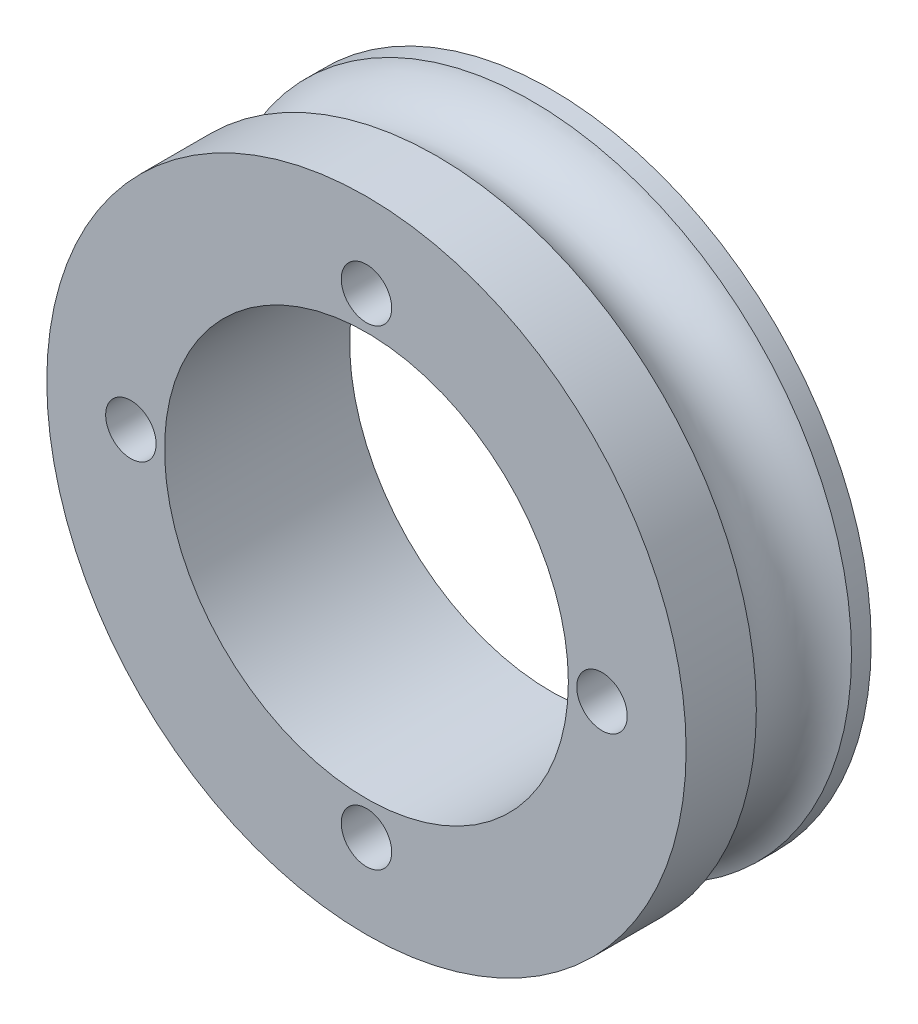
ISO-10303-21;
HEADER;
FILE_DESCRIPTION(('STEP AP214'),'2;1');
FILE_NAME('part.step','',(''),(''),'','','');
FILE_SCHEMA(('AUTOMOTIVE_DESIGN { 1 0 10303 214 1 1 1 1 }'));
ENDSEC;
DATA;
#1=APPLICATION_CONTEXT('core data for automotive mechanical design processes');
#2=APPLICATION_PROTOCOL_DEFINITION('international standard','automotive_design',2000,#1);
#3=PRODUCT_CONTEXT('',#1,'mechanical');
#4=PRODUCT('Part','Part','',(#3));
#5=PRODUCT_RELATED_PRODUCT_CATEGORY('part','',(#4));
#6=PRODUCT_DEFINITION_FORMATION('','',#4);
#7=PRODUCT_DEFINITION_CONTEXT('part definition',#1,'design');
#8=PRODUCT_DEFINITION('design','',#6,#7);
#9=PRODUCT_DEFINITION_SHAPE('','',#8);
#10=(LENGTH_UNIT() NAMED_UNIT(*) SI_UNIT(.MILLI.,.METRE.));
#11=(NAMED_UNIT(*) PLANE_ANGLE_UNIT() SI_UNIT($,.RADIAN.));
#12=(NAMED_UNIT(*) SI_UNIT($,.STERADIAN.) SOLID_ANGLE_UNIT());
#13=UNCERTAINTY_MEASURE_WITH_UNIT(LENGTH_MEASURE(1.E-05),#10,'distance_accuracy_value','');
#14=(GEOMETRIC_REPRESENTATION_CONTEXT(3) GLOBAL_UNCERTAINTY_ASSIGNED_CONTEXT((#13)) GLOBAL_UNIT_ASSIGNED_CONTEXT((#10,
#11,#12)) REPRESENTATION_CONTEXT('',''));
#15=CARTESIAN_POINT('',(0.,0.,0.));
#16=DIRECTION('',(0.,0.,1.));
#17=DIRECTION('',(1.,0.,0.));
#18=AXIS2_PLACEMENT_3D('',#15,#16,#17);
#19=CARTESIAN_POINT('',(0.,0.,11.));
#20=DIRECTION('',(0.,0.,-1.));
#21=DIRECTION('',(-1.,0.,0.));
#22=AXIS2_PLACEMENT_3D('',#19,#20,#21);
#23=CYLINDRICAL_SURFACE('',#22,19.);
#24=CARTESIAN_POINT('',(0.,0.,11.));
#25=DIRECTION('',(0.,0.,1.));
#26=DIRECTION('',(1.,0.,0.));
#27=AXIS2_PLACEMENT_3D('',#24,#25,#26);
#28=CIRCLE('',#27,19.);
#29=CARTESIAN_POINT('',(19.,0.,11.));
#30=VERTEX_POINT('',#29);
#31=EDGE_CURVE('E10',#30,#30,#28,.T.);
#32=ORIENTED_EDGE('',*,*,#31,.F.);
#33=EDGE_LOOP('',(#32));
#34=FACE_BOUND('',#33,.T.);
#35=CARTESIAN_POINT('',(0.,0.,6.82842712474619));
#36=DIRECTION('',(0.,0.,-1.));
#37=DIRECTION('',(-1.,0.,0.));
#38=AXIS2_PLACEMENT_3D('',#35,#36,#37);
#39=CIRCLE('',#38,19.);
#40=CARTESIAN_POINT('',(-19.,0.,6.82842712474619));
#41=VERTEX_POINT('',#40);
#42=EDGE_CURVE('E34',#41,#41,#39,.T.);
#43=ORIENTED_EDGE('',*,*,#42,.F.);
#44=EDGE_LOOP('',(#43));
#45=FACE_BOUND('',#44,.T.);
#46=ADVANCED_FACE('F31',(#34,#45),#23,.T.);
#47=CARTESIAN_POINT('',(0.,0.,0.));
#48=DIRECTION('',(0.,0.,1.));
#49=DIRECTION('',(1.,0.,0.));
#50=AXIS2_PLACEMENT_3D('',#47,#48,#49);
#51=CIRCLE('',#50,19.);
#52=CARTESIAN_POINT('',(19.,0.,0.));
#53=VERTEX_POINT('',#52);
#54=EDGE_CURVE('E38',#53,#53,#51,.T.);
#55=ORIENTED_EDGE('',*,*,#54,.T.);
#56=EDGE_LOOP('',(#55));
#57=FACE_BOUND('',#56,.T.);
#58=CARTESIAN_POINT('',(0.,0.,1.17157287525381));
#59=DIRECTION('',(0.,0.,1.));
#60=DIRECTION('',(1.,0.,0.));
#61=AXIS2_PLACEMENT_3D('',#58,#59,#60);
#62=CIRCLE('',#61,19.);
#63=CARTESIAN_POINT('',(19.,0.,1.17157287525381));
#64=VERTEX_POINT('',#63);
#65=EDGE_CURVE('E48',#64,#64,#62,.T.);
#66=ORIENTED_EDGE('',*,*,#65,.F.);
#67=EDGE_LOOP('',(#66));
#68=FACE_BOUND('',#67,.T.);
#69=ADVANCED_FACE('F105',(#57,#68),#23,.T.);
#70=CARTESIAN_POINT('',(0.,0.,11.));
#71=DIRECTION('',(0.,0.,1.));
#72=DIRECTION('',(1.,0.,0.));
#73=AXIS2_PLACEMENT_3D('',#70,#71,#72);
#74=PLANE('',#73);
#75=CARTESIAN_POINT('',(0.,-14.,11.));
#76=DIRECTION('',(0.,0.,1.));
#77=DIRECTION('',(1.,0.,0.));
#78=AXIS2_PLACEMENT_3D('',#75,#76,#77);
#79=CIRCLE('',#78,1.5);
#80=CARTESIAN_POINT('',(1.5,-14.,11.));
#81=VERTEX_POINT('',#80);
#82=EDGE_CURVE('E65',#81,#81,#79,.T.);
#83=ORIENTED_EDGE('',*,*,#82,.F.);
#84=EDGE_LOOP('',(#83));
#85=FACE_BOUND('',#84,.T.);
#86=CARTESIAN_POINT('',(0.,14.,11.));
#87=DIRECTION('',(0.,0.,1.));
#88=DIRECTION('',(1.,0.,0.));
#89=AXIS2_PLACEMENT_3D('',#86,#87,#88);
#90=CIRCLE('',#89,1.5);
#91=CARTESIAN_POINT('',(1.5,14.,11.));
#92=VERTEX_POINT('',#91);
#93=EDGE_CURVE('E77',#92,#92,#90,.T.);
#94=ORIENTED_EDGE('',*,*,#93,.F.);
#95=EDGE_LOOP('',(#94));
#96=FACE_BOUND('',#95,.T.);
#97=ORIENTED_EDGE('',*,*,#31,.T.);
#98=EDGE_LOOP('',(#97));
#99=FACE_BOUND('',#98,.T.);
#100=CARTESIAN_POINT('',(0.,0.,11.));
#101=DIRECTION('',(0.,0.,1.));
#102=DIRECTION('',(1.,0.,0.));
#103=AXIS2_PLACEMENT_3D('',#100,#101,#102);
#104=CIRCLE('',#103,12.);
#105=CARTESIAN_POINT('',(12.,0.,11.));
#106=VERTEX_POINT('',#105);
#107=EDGE_CURVE('E43',#106,#106,#104,.T.);
#108=ORIENTED_EDGE('',*,*,#107,.F.);
#109=EDGE_LOOP('',(#108));
#110=FACE_BOUND('',#109,.T.);
#111=CARTESIAN_POINT('',(14.,0.,11.));
#112=DIRECTION('',(0.,0.,1.));
#113=DIRECTION('',(1.,0.,0.));
#114=AXIS2_PLACEMENT_3D('',#111,#112,#113);
#115=CIRCLE('',#114,1.5);
#116=CARTESIAN_POINT('',(15.5,0.,11.));
#117=VERTEX_POINT('',#116);
#118=EDGE_CURVE('E71',#117,#117,#115,.T.);
#119=ORIENTED_EDGE('',*,*,#118,.F.);
#120=EDGE_LOOP('',(#119));
#121=FACE_BOUND('',#120,.T.);
#122=CARTESIAN_POINT('',(-14.,0.,11.));
#123=DIRECTION('',(0.,0.,1.));
#124=DIRECTION('',(1.,0.,0.));
#125=AXIS2_PLACEMENT_3D('',#122,#123,#124);
#126=CIRCLE('',#125,1.5);
#127=CARTESIAN_POINT('',(-12.5,0.,11.));
#128=VERTEX_POINT('',#127);
#129=EDGE_CURVE('E57',#128,#128,#126,.T.);
#130=ORIENTED_EDGE('',*,*,#129,.F.);
#131=EDGE_LOOP('',(#130));
#132=FACE_BOUND('',#131,.T.);
#133=ADVANCED_FACE('F101',(#85,#96,#99,#110,#121,#132),#74,.T.);
#134=CARTESIAN_POINT('',(0.,0.,0.));
#135=DIRECTION('',(0.,0.,1.));
#136=DIRECTION('',(1.,0.,0.));
#137=AXIS2_PLACEMENT_3D('',#134,#135,#136);
#138=PLANE('',#137);
#139=ORIENTED_EDGE('',*,*,#54,.F.);
#140=EDGE_LOOP('',(#139));
#141=FACE_BOUND('',#140,.T.);
#142=CARTESIAN_POINT('',(0.,0.,0.));
#143=DIRECTION('',(0.,0.,1.));
#144=DIRECTION('',(1.,0.,0.));
#145=AXIS2_PLACEMENT_3D('',#142,#143,#144);
#146=CIRCLE('',#145,12.);
#147=CARTESIAN_POINT('',(12.,0.,0.));
#148=VERTEX_POINT('',#147);
#149=EDGE_CURVE('E46',#148,#148,#146,.T.);
#150=ORIENTED_EDGE('',*,*,#149,.T.);
#151=EDGE_LOOP('',(#150));
#152=FACE_BOUND('',#151,.T.);
#153=CARTESIAN_POINT('',(0.,14.,0.));
#154=DIRECTION('',(0.,0.,1.));
#155=DIRECTION('',(1.,0.,0.));
#156=AXIS2_PLACEMENT_3D('',#153,#154,#155);
#157=CIRCLE('',#156,1.5);
#158=CARTESIAN_POINT('',(1.5,14.,0.));
#159=VERTEX_POINT('',#158);
#160=EDGE_CURVE('E74',#159,#159,#157,.T.);
#161=ORIENTED_EDGE('',*,*,#160,.T.);
#162=EDGE_LOOP('',(#161));
#163=FACE_BOUND('',#162,.T.);
#164=CARTESIAN_POINT('',(14.,0.,0.));
#165=DIRECTION('',(0.,0.,1.));
#166=DIRECTION('',(1.,0.,0.));
#167=AXIS2_PLACEMENT_3D('',#164,#165,#166);
#168=CIRCLE('',#167,1.5);
#169=CARTESIAN_POINT('',(15.5,0.,0.));
#170=VERTEX_POINT('',#169);
#171=EDGE_CURVE('E68',#170,#170,#168,.T.);
#172=ORIENTED_EDGE('',*,*,#171,.T.);
#173=EDGE_LOOP('',(#172));
#174=FACE_BOUND('',#173,.T.);
#175=CARTESIAN_POINT('',(0.,-14.,0.));
#176=DIRECTION('',(0.,0.,1.));
#177=DIRECTION('',(1.,0.,0.));
#178=AXIS2_PLACEMENT_3D('',#175,#176,#177);
#179=CIRCLE('',#178,1.5);
#180=CARTESIAN_POINT('',(1.5,-14.,0.));
#181=VERTEX_POINT('',#180);
#182=EDGE_CURVE('E62',#181,#181,#179,.T.);
#183=ORIENTED_EDGE('',*,*,#182,.T.);
#184=EDGE_LOOP('',(#183));
#185=FACE_BOUND('',#184,.T.);
#186=CARTESIAN_POINT('',(-14.,0.,0.));
#187=DIRECTION('',(0.,0.,1.));
#188=DIRECTION('',(1.,0.,0.));
#189=AXIS2_PLACEMENT_3D('',#186,#187,#188);
#190=CIRCLE('',#189,1.5);
#191=CARTESIAN_POINT('',(-12.5,0.,0.));
#192=VERTEX_POINT('',#191);
#193=EDGE_CURVE('E53',#192,#192,#190,.T.);
#194=ORIENTED_EDGE('',*,*,#193,.T.);
#195=EDGE_LOOP('',(#194));
#196=FACE_BOUND('',#195,.T.);
#197=ADVANCED_FACE('F87',(#141,#152,#163,#174,#185,#196),#138,.F.);
#198=CARTESIAN_POINT('',(0.,0.,11.));
#199=DIRECTION('',(0.,0.,-1.));
#200=DIRECTION('',(-1.,0.,0.));
#201=AXIS2_PLACEMENT_3D('',#198,#199,#200);
#202=CYLINDRICAL_SURFACE('',#201,12.);
#203=ORIENTED_EDGE('',*,*,#107,.T.);
#204=EDGE_LOOP('',(#203));
#205=FACE_BOUND('',#204,.T.);
#206=ORIENTED_EDGE('',*,*,#149,.F.);
#207=EDGE_LOOP('',(#206));
#208=FACE_BOUND('',#207,.T.);
#209=ADVANCED_FACE('F90',(#205,#208),#202,.F.);
#210=CARTESIAN_POINT('',(0.,14.,11.));
#211=DIRECTION('',(0.,0.,-1.));
#212=DIRECTION('',(-1.,0.,0.));
#213=AXIS2_PLACEMENT_3D('',#210,#211,#212);
#214=CYLINDRICAL_SURFACE('',#213,1.5);
#215=ORIENTED_EDGE('',*,*,#93,.T.);
#216=EDGE_LOOP('',(#215));
#217=FACE_BOUND('',#216,.T.);
#218=ORIENTED_EDGE('',*,*,#160,.F.);
#219=EDGE_LOOP('',(#218));
#220=FACE_BOUND('',#219,.T.);
#221=ADVANCED_FACE('F92',(#217,#220),#214,.F.);
#222=CARTESIAN_POINT('',(14.,0.,11.));
#223=DIRECTION('',(0.,0.,-1.));
#224=DIRECTION('',(-1.,0.,0.));
#225=AXIS2_PLACEMENT_3D('',#222,#223,#224);
#226=CYLINDRICAL_SURFACE('',#225,1.5);
#227=ORIENTED_EDGE('',*,*,#118,.T.);
#228=EDGE_LOOP('',(#227));
#229=FACE_BOUND('',#228,.T.);
#230=ORIENTED_EDGE('',*,*,#171,.F.);
#231=EDGE_LOOP('',(#230));
#232=FACE_BOUND('',#231,.T.);
#233=ADVANCED_FACE('F98',(#229,#232),#226,.F.);
#234=CARTESIAN_POINT('',(0.,-14.,11.));
#235=DIRECTION('',(0.,0.,-1.));
#236=DIRECTION('',(-1.,0.,0.));
#237=AXIS2_PLACEMENT_3D('',#234,#235,#236);
#238=CYLINDRICAL_SURFACE('',#237,1.5);
#239=ORIENTED_EDGE('',*,*,#82,.T.);
#240=EDGE_LOOP('',(#239));
#241=FACE_BOUND('',#240,.T.);
#242=ORIENTED_EDGE('',*,*,#182,.F.);
#243=EDGE_LOOP('',(#242));
#244=FACE_BOUND('',#243,.T.);
#245=ADVANCED_FACE('F133',(#241,#244),#238,.F.);
#246=CARTESIAN_POINT('',(-14.,0.,11.));
#247=DIRECTION('',(0.,0.,-1.));
#248=DIRECTION('',(-1.,0.,0.));
#249=AXIS2_PLACEMENT_3D('',#246,#247,#248);
#250=CYLINDRICAL_SURFACE('',#249,1.5);
#251=ORIENTED_EDGE('',*,*,#129,.T.);
#252=EDGE_LOOP('',(#251));
#253=FACE_BOUND('',#252,.T.);
#254=ORIENTED_EDGE('',*,*,#193,.F.);
#255=EDGE_LOOP('',(#254));
#256=FACE_BOUND('',#255,.T.);
#257=ADVANCED_FACE('F129',(#253,#256),#250,.F.);
#258=CARTESIAN_POINT('',(0.,0.,4.));
#259=DIRECTION('',(0.,0.,1.));
#260=DIRECTION('',(1.,0.,0.));
#261=AXIS2_PLACEMENT_3D('',#258,#259,#260);
#262=TOROIDAL_SURFACE('',#261,20.,3.);
#263=ORIENTED_EDGE('',*,*,#65,.T.);
#264=EDGE_LOOP('',(#263));
#265=FACE_BOUND('',#264,.T.);
#266=ORIENTED_EDGE('',*,*,#42,.T.);
#267=EDGE_LOOP('',(#266));
#268=FACE_BOUND('',#267,.T.);
#269=ADVANCED_FACE('F132',(#265,#268),#262,.F.);
#270=CLOSED_SHELL('',(#46,#69,#133,#197,#209,#221,#233,#245,#257,#269));
#271=MANIFOLD_SOLID_BREP('B2',#270);
#272=ADVANCED_BREP_SHAPE_REPRESENTATION('',(#18,#271),#14);
#273=SHAPE_DEFINITION_REPRESENTATION(#9,#272);
ENDSEC;
END-ISO-10303-21;
